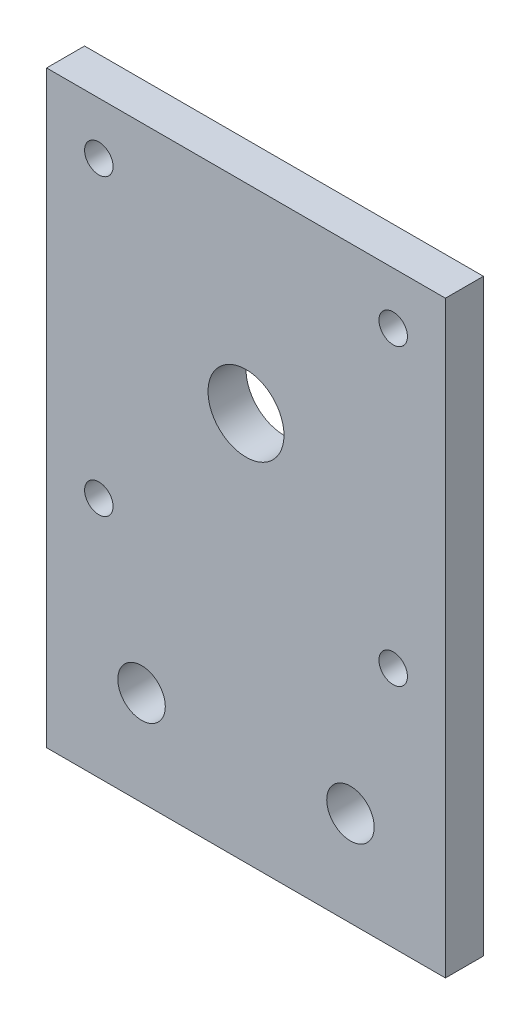
ISO-10303-21;
HEADER;
FILE_DESCRIPTION(('STEP AP214'),'2;1');
FILE_NAME('part.step','',(''),(''),'','','');
FILE_SCHEMA(('AUTOMOTIVE_DESIGN { 1 0 10303 214 1 1 1 1 }'));
ENDSEC;
DATA;
#1=APPLICATION_CONTEXT('core data for automotive mechanical design processes');
#2=APPLICATION_PROTOCOL_DEFINITION('international standard','automotive_design',2000,#1);
#3=PRODUCT_CONTEXT('',#1,'mechanical');
#4=PRODUCT('Part','Part','',(#3));
#5=PRODUCT_RELATED_PRODUCT_CATEGORY('part','',(#4));
#6=PRODUCT_DEFINITION_FORMATION('','',#4);
#7=PRODUCT_DEFINITION_CONTEXT('part definition',#1,'design');
#8=PRODUCT_DEFINITION('design','',#6,#7);
#9=PRODUCT_DEFINITION_SHAPE('','',#8);
#10=(LENGTH_UNIT() NAMED_UNIT(*) SI_UNIT(.MILLI.,.METRE.));
#11=(NAMED_UNIT(*) PLANE_ANGLE_UNIT() SI_UNIT($,.RADIAN.));
#12=(NAMED_UNIT(*) SI_UNIT($,.STERADIAN.) SOLID_ANGLE_UNIT());
#13=UNCERTAINTY_MEASURE_WITH_UNIT(LENGTH_MEASURE(1.E-05),#10,'distance_accuracy_value','');
#14=(GEOMETRIC_REPRESENTATION_CONTEXT(3) GLOBAL_UNCERTAINTY_ASSIGNED_CONTEXT((#13)) GLOBAL_UNIT_ASSIGNED_CONTEXT((#10,
#11,#12)) REPRESENTATION_CONTEXT('',''));
#15=CARTESIAN_POINT('',(0.,0.,0.));
#16=DIRECTION('',(0.,0.,1.));
#17=DIRECTION('',(1.,0.,0.));
#18=AXIS2_PLACEMENT_3D('',#15,#16,#17);
#19=CARTESIAN_POINT('',(0.,0.,4.));
#20=DIRECTION('',(0.,0.,1.));
#21=DIRECTION('',(1.,0.,0.));
#22=AXIS2_PLACEMENT_3D('',#19,#20,#21);
#23=PLANE('',#22);
#24=CARTESIAN_POINT('',(11.,-31.,4.));
#25=DIRECTION('',(0.,0.,1.));
#26=DIRECTION('',(1.,0.,0.));
#27=AXIS2_PLACEMENT_3D('',#24,#25,#26);
#28=CIRCLE('',#27,2.5);
#29=CARTESIAN_POINT('',(13.5,-31.,4.));
#30=VERTEX_POINT('',#29);
#31=EDGE_CURVE('E107',#30,#30,#28,.T.);
#32=ORIENTED_EDGE('',*,*,#31,.F.);
#33=EDGE_LOOP('',(#32));
#34=FACE_BOUND('',#33,.T.);
#35=CARTESIAN_POINT('',(-11.,-31.,4.));
#36=DIRECTION('',(0.,0.,1.));
#37=DIRECTION('',(1.,0.,0.));
#38=AXIS2_PLACEMENT_3D('',#35,#36,#37);
#39=CIRCLE('',#38,2.5);
#40=CARTESIAN_POINT('',(-8.49999999999999,-31.,4.));
#41=VERTEX_POINT('',#40);
#42=EDGE_CURVE('E111',#41,#41,#39,.T.);
#43=ORIENTED_EDGE('',*,*,#42,.F.);
#44=EDGE_LOOP('',(#43));
#45=FACE_BOUND('',#44,.T.);
#46=CARTESIAN_POINT('',(15.5000000000008,-15.4999999999991,4.));
#47=DIRECTION('',(0.,0.,1.));
#48=DIRECTION('',(1.,0.,0.));
#49=AXIS2_PLACEMENT_3D('',#46,#47,#48);
#50=CIRCLE('',#49,1.50000000000121);
#51=CARTESIAN_POINT('',(17.000000000002,-15.4999999999991,4.));
#52=VERTEX_POINT('',#51);
#53=EDGE_CURVE('E128',#52,#52,#50,.T.);
#54=ORIENTED_EDGE('',*,*,#53,.F.);
#55=EDGE_LOOP('',(#54));
#56=FACE_BOUND('',#55,.T.);
#57=CARTESIAN_POINT('',(-15.5,15.5,4.));
#58=DIRECTION('',(0.,0.,1.));
#59=DIRECTION('',(1.,0.,0.));
#60=AXIS2_PLACEMENT_3D('',#57,#58,#59);
#61=CIRCLE('',#60,1.5);
#62=CARTESIAN_POINT('',(-14.,15.5,4.));
#63=VERTEX_POINT('',#62);
#64=EDGE_CURVE('E144',#63,#63,#61,.T.);
#65=ORIENTED_EDGE('',*,*,#64,.F.);
#66=EDGE_LOOP('',(#65));
#67=FACE_BOUND('',#66,.T.);
#68=DIRECTION('',(0.,-1.,0.));
#69=VECTOR('',#68,1.);
#70=CARTESIAN_POINT('',(-21.,-21.,4.));
#71=LINE('',#70,#69);
#72=CARTESIAN_POINT('',(-21.,21.,4.));
#73=VERTEX_POINT('',#72);
#74=CARTESIAN_POINT('',(-21.,-41.,4.));
#75=VERTEX_POINT('',#74);
#76=EDGE_CURVE('E84',#73,#75,#71,.T.);
#77=ORIENTED_EDGE('',*,*,#76,.T.);
#78=DIRECTION('',(-1.,0.,0.));
#79=VECTOR('',#78,1.);
#80=CARTESIAN_POINT('',(-21.,-41.,4.));
#81=LINE('',#80,#79);
#82=CARTESIAN_POINT('',(21.,-41.,4.));
#83=VERTEX_POINT('',#82);
#84=EDGE_CURVE('E88',#83,#75,#81,.T.);
#85=ORIENTED_EDGE('',*,*,#84,.F.);
#86=DIRECTION('',(0.,1.,0.));
#87=VECTOR('',#86,1.);
#88=CARTESIAN_POINT('',(21.,-21.,4.));
#89=LINE('',#88,#87);
#90=CARTESIAN_POINT('',(21.,21.,4.));
#91=VERTEX_POINT('',#90);
#92=EDGE_CURVE('E74',#83,#91,#89,.T.);
#93=ORIENTED_EDGE('',*,*,#92,.T.);
#94=DIRECTION('',(-1.,0.,0.));
#95=VECTOR('',#94,1.);
#96=CARTESIAN_POINT('',(21.,21.,4.));
#97=LINE('',#96,#95);
#98=EDGE_CURVE('E59',#91,#73,#97,.T.);
#99=ORIENTED_EDGE('',*,*,#98,.T.);
#100=EDGE_LOOP('',(#77,#85,#93,#99));
#101=FACE_BOUND('',#100,.T.);
#102=CARTESIAN_POINT('',(0.,0.,4.));
#103=DIRECTION('',(0.,0.,1.));
#104=DIRECTION('',(1.,0.,0.));
#105=AXIS2_PLACEMENT_3D('',#102,#103,#104);
#106=CIRCLE('',#105,4.);
#107=CARTESIAN_POINT('',(4.,0.,4.));
#108=VERTEX_POINT('',#107);
#109=EDGE_CURVE('E152',#108,#108,#106,.T.);
#110=ORIENTED_EDGE('',*,*,#109,.F.);
#111=EDGE_LOOP('',(#110));
#112=FACE_BOUND('',#111,.T.);
#113=CARTESIAN_POINT('',(15.5,15.5000000000008,4.));
#114=DIRECTION('',(0.,0.,1.));
#115=DIRECTION('',(1.,0.,0.));
#116=AXIS2_PLACEMENT_3D('',#113,#114,#115);
#117=CIRCLE('',#116,1.50000000000089);
#118=CARTESIAN_POINT('',(17.0000000000009,15.5000000000008,4.));
#119=VERTEX_POINT('',#118);
#120=EDGE_CURVE('E136',#119,#119,#117,.T.);
#121=ORIENTED_EDGE('',*,*,#120,.F.);
#122=EDGE_LOOP('',(#121));
#123=FACE_BOUND('',#122,.T.);
#124=CARTESIAN_POINT('',(-15.4999999999991,-15.5,4.));
#125=DIRECTION('',(0.,0.,1.));
#126=DIRECTION('',(1.,0.,0.));
#127=AXIS2_PLACEMENT_3D('',#124,#125,#126);
#128=CIRCLE('',#127,1.50000000000046);
#129=CARTESIAN_POINT('',(-13.9999999999987,-15.5,4.));
#130=VERTEX_POINT('',#129);
#131=EDGE_CURVE('E120',#130,#130,#128,.T.);
#132=ORIENTED_EDGE('',*,*,#131,.F.);
#133=EDGE_LOOP('',(#132));
#134=FACE_BOUND('',#133,.T.);
#135=ADVANCED_FACE('F41',(#34,#45,#56,#67,#101,#112,#123,#134),#23,.T.);
#136=CARTESIAN_POINT('',(0.,0.,0.));
#137=DIRECTION('',(0.,0.,1.));
#138=DIRECTION('',(1.,0.,0.));
#139=AXIS2_PLACEMENT_3D('',#136,#137,#138);
#140=PLANE('',#139);
#141=CARTESIAN_POINT('',(11.,-31.,0.));
#142=DIRECTION('',(0.,0.,-1.));
#143=DIRECTION('',(-1.,0.,0.));
#144=AXIS2_PLACEMENT_3D('',#141,#142,#143);
#145=CIRCLE('',#144,2.5);
#146=CARTESIAN_POINT('',(8.5,-31.,0.));
#147=VERTEX_POINT('',#146);
#148=EDGE_CURVE('E227',#147,#147,#145,.T.);
#149=ORIENTED_EDGE('',*,*,#148,.F.);
#150=EDGE_LOOP('',(#149));
#151=FACE_BOUND('',#150,.T.);
#152=CARTESIAN_POINT('',(-11.,-31.,0.));
#153=DIRECTION('',(0.,0.,-1.));
#154=DIRECTION('',(-1.,0.,0.));
#155=AXIS2_PLACEMENT_3D('',#152,#153,#154);
#156=CIRCLE('',#155,2.5);
#157=CARTESIAN_POINT('',(-13.5,-31.,0.));
#158=VERTEX_POINT('',#157);
#159=EDGE_CURVE('E229',#158,#158,#156,.T.);
#160=ORIENTED_EDGE('',*,*,#159,.F.);
#161=EDGE_LOOP('',(#160));
#162=FACE_BOUND('',#161,.T.);
#163=DIRECTION('',(0.,-1.,0.));
#164=VECTOR('',#163,1.);
#165=CARTESIAN_POINT('',(-21.,-21.,0.));
#166=LINE('',#165,#164);
#167=CARTESIAN_POINT('',(-21.,21.,0.));
#168=VERTEX_POINT('',#167);
#169=CARTESIAN_POINT('',(-21.,-41.,0.));
#170=VERTEX_POINT('',#169);
#171=EDGE_CURVE('E97',#168,#170,#166,.T.);
#172=ORIENTED_EDGE('',*,*,#171,.F.);
#173=DIRECTION('',(-1.,0.,0.));
#174=VECTOR('',#173,1.);
#175=CARTESIAN_POINT('',(21.,21.,0.));
#176=LINE('',#175,#174);
#177=CARTESIAN_POINT('',(21.,21.,0.));
#178=VERTEX_POINT('',#177);
#179=EDGE_CURVE('E92',#178,#168,#176,.T.);
#180=ORIENTED_EDGE('',*,*,#179,.F.);
#181=DIRECTION('',(0.,1.,0.));
#182=VECTOR('',#181,1.);
#183=CARTESIAN_POINT('',(21.,-21.,0.));
#184=LINE('',#183,#182);
#185=CARTESIAN_POINT('',(21.,-41.,0.));
#186=VERTEX_POINT('',#185);
#187=EDGE_CURVE('E70',#186,#178,#184,.T.);
#188=ORIENTED_EDGE('',*,*,#187,.F.);
#189=DIRECTION('',(1.,0.,0.));
#190=VECTOR('',#189,1.);
#191=CARTESIAN_POINT('',(-21.,-41.,0.));
#192=LINE('',#191,#190);
#193=EDGE_CURVE('E102',#170,#186,#192,.T.);
#194=ORIENTED_EDGE('',*,*,#193,.F.);
#195=EDGE_LOOP('',(#172,#180,#188,#194));
#196=FACE_BOUND('',#195,.T.);
#197=CARTESIAN_POINT('',(0.,0.,0.));
#198=DIRECTION('',(0.,0.,1.));
#199=DIRECTION('',(1.,0.,0.));
#200=AXIS2_PLACEMENT_3D('',#197,#198,#199);
#201=CIRCLE('',#200,4.);
#202=CARTESIAN_POINT('',(4.,0.,0.));
#203=VERTEX_POINT('',#202);
#204=EDGE_CURVE('E148',#203,#203,#201,.T.);
#205=ORIENTED_EDGE('',*,*,#204,.T.);
#206=EDGE_LOOP('',(#205));
#207=FACE_BOUND('',#206,.T.);
#208=CARTESIAN_POINT('',(-15.5,15.5,0.));
#209=DIRECTION('',(0.,0.,1.));
#210=DIRECTION('',(1.,0.,0.));
#211=AXIS2_PLACEMENT_3D('',#208,#209,#210);
#212=CIRCLE('',#211,1.5);
#213=CARTESIAN_POINT('',(-14.,15.5,0.));
#214=VERTEX_POINT('',#213);
#215=EDGE_CURVE('E140',#214,#214,#212,.T.);
#216=ORIENTED_EDGE('',*,*,#215,.T.);
#217=EDGE_LOOP('',(#216));
#218=FACE_BOUND('',#217,.T.);
#219=CARTESIAN_POINT('',(15.5,15.5000000000008,0.));
#220=DIRECTION('',(0.,0.,1.));
#221=DIRECTION('',(1.,0.,0.));
#222=AXIS2_PLACEMENT_3D('',#219,#220,#221);
#223=CIRCLE('',#222,1.50000000000089);
#224=CARTESIAN_POINT('',(17.0000000000009,15.5000000000008,0.));
#225=VERTEX_POINT('',#224);
#226=EDGE_CURVE('E132',#225,#225,#223,.T.);
#227=ORIENTED_EDGE('',*,*,#226,.T.);
#228=EDGE_LOOP('',(#227));
#229=FACE_BOUND('',#228,.T.);
#230=CARTESIAN_POINT('',(15.5000000000008,-15.4999999999991,0.));
#231=DIRECTION('',(0.,0.,1.));
#232=DIRECTION('',(1.,0.,0.));
#233=AXIS2_PLACEMENT_3D('',#230,#231,#232);
#234=CIRCLE('',#233,1.50000000000121);
#235=CARTESIAN_POINT('',(17.000000000002,-15.4999999999991,0.));
#236=VERTEX_POINT('',#235);
#237=EDGE_CURVE('E124',#236,#236,#234,.T.);
#238=ORIENTED_EDGE('',*,*,#237,.T.);
#239=EDGE_LOOP('',(#238));
#240=FACE_BOUND('',#239,.T.);
#241=CARTESIAN_POINT('',(-15.4999999999991,-15.5,0.));
#242=DIRECTION('',(0.,0.,1.));
#243=DIRECTION('',(1.,0.,0.));
#244=AXIS2_PLACEMENT_3D('',#241,#242,#243);
#245=CIRCLE('',#244,1.50000000000046);
#246=CARTESIAN_POINT('',(-13.9999999999987,-15.5,0.));
#247=VERTEX_POINT('',#246);
#248=EDGE_CURVE('E119',#247,#247,#245,.T.);
#249=ORIENTED_EDGE('',*,*,#248,.T.);
#250=EDGE_LOOP('',(#249));
#251=FACE_BOUND('',#250,.T.);
#252=ADVANCED_FACE('F172',(#151,#162,#196,#207,#218,#229,#240,#251),#140,.F.);
#253=CARTESIAN_POINT('',(-21.,-21.,4.));
#254=DIRECTION('',(1.,0.,0.));
#255=DIRECTION('',(0.,0.,-1.));
#256=AXIS2_PLACEMENT_3D('',#253,#254,#255);
#257=PLANE('',#256);
#258=ORIENTED_EDGE('',*,*,#171,.T.);
#259=DIRECTION('',(0.,0.,-1.));
#260=VECTOR('',#259,1.);
#261=CARTESIAN_POINT('',(-21.,-41.,4.));
#262=LINE('',#261,#260);
#263=EDGE_CURVE('E95',#75,#170,#262,.T.);
#264=ORIENTED_EDGE('',*,*,#263,.F.);
#265=ORIENTED_EDGE('',*,*,#76,.F.);
#266=DIRECTION('',(0.,0.,-1.));
#267=VECTOR('',#266,1.);
#268=CARTESIAN_POINT('',(-21.,21.,4.));
#269=LINE('',#268,#267);
#270=EDGE_CURVE('E51',#73,#168,#269,.T.);
#271=ORIENTED_EDGE('',*,*,#270,.T.);
#272=EDGE_LOOP('',(#258,#264,#265,#271));
#273=FACE_BOUND('',#272,.T.);
#274=ADVANCED_FACE('F43',(#273),#257,.F.);
#275=CARTESIAN_POINT('',(21.,-21.,4.));
#276=DIRECTION('',(-1.,0.,0.));
#277=DIRECTION('',(0.,0.,1.));
#278=AXIS2_PLACEMENT_3D('',#275,#276,#277);
#279=PLANE('',#278);
#280=ORIENTED_EDGE('',*,*,#187,.T.);
#281=DIRECTION('',(0.,0.,-1.));
#282=VECTOR('',#281,1.);
#283=CARTESIAN_POINT('',(21.,21.,4.));
#284=LINE('',#283,#282);
#285=EDGE_CURVE('E11',#91,#178,#284,.T.);
#286=ORIENTED_EDGE('',*,*,#285,.F.);
#287=ORIENTED_EDGE('',*,*,#92,.F.);
#288=DIRECTION('',(0.,0.,1.));
#289=VECTOR('',#288,1.);
#290=CARTESIAN_POINT('',(21.,-41.,4.));
#291=LINE('',#290,#289);
#292=EDGE_CURVE('E105',#186,#83,#291,.T.);
#293=ORIENTED_EDGE('',*,*,#292,.F.);
#294=EDGE_LOOP('',(#280,#286,#287,#293));
#295=FACE_BOUND('',#294,.T.);
#296=ADVANCED_FACE('F174',(#295),#279,.F.);
#297=CARTESIAN_POINT('',(21.,21.,4.));
#298=DIRECTION('',(0.,-1.,0.));
#299=DIRECTION('',(1.,0.,0.));
#300=AXIS2_PLACEMENT_3D('',#297,#298,#299);
#301=PLANE('',#300);
#302=ORIENTED_EDGE('',*,*,#179,.T.);
#303=ORIENTED_EDGE('',*,*,#270,.F.);
#304=ORIENTED_EDGE('',*,*,#98,.F.);
#305=ORIENTED_EDGE('',*,*,#285,.T.);
#306=EDGE_LOOP('',(#302,#303,#304,#305));
#307=FACE_BOUND('',#306,.T.);
#308=ADVANCED_FACE('F176',(#307),#301,.F.);
#309=CARTESIAN_POINT('',(0.,0.,4.));
#310=DIRECTION('',(0.,0.,-1.));
#311=DIRECTION('',(-1.,0.,0.));
#312=AXIS2_PLACEMENT_3D('',#309,#310,#311);
#313=CYLINDRICAL_SURFACE('',#312,4.);
#314=ORIENTED_EDGE('',*,*,#109,.T.);
#315=EDGE_LOOP('',(#314));
#316=FACE_BOUND('',#315,.T.);
#317=ORIENTED_EDGE('',*,*,#204,.F.);
#318=EDGE_LOOP('',(#317));
#319=FACE_BOUND('',#318,.T.);
#320=ADVANCED_FACE('F182',(#316,#319),#313,.F.);
#321=CARTESIAN_POINT('',(-15.5,15.5,4.));
#322=DIRECTION('',(0.,0.,-1.));
#323=DIRECTION('',(-1.,0.,0.));
#324=AXIS2_PLACEMENT_3D('',#321,#322,#323);
#325=CYLINDRICAL_SURFACE('',#324,1.5);
#326=ORIENTED_EDGE('',*,*,#64,.T.);
#327=EDGE_LOOP('',(#326));
#328=FACE_BOUND('',#327,.T.);
#329=ORIENTED_EDGE('',*,*,#215,.F.);
#330=EDGE_LOOP('',(#329));
#331=FACE_BOUND('',#330,.T.);
#332=ADVANCED_FACE('F198',(#328,#331),#325,.F.);
#333=CARTESIAN_POINT('',(15.5,15.5000000000008,4.));
#334=DIRECTION('',(0.,0.,-1.));
#335=DIRECTION('',(-1.,0.,0.));
#336=AXIS2_PLACEMENT_3D('',#333,#334,#335);
#337=CYLINDRICAL_SURFACE('',#336,1.50000000000089);
#338=ORIENTED_EDGE('',*,*,#120,.T.);
#339=EDGE_LOOP('',(#338));
#340=FACE_BOUND('',#339,.T.);
#341=ORIENTED_EDGE('',*,*,#226,.F.);
#342=EDGE_LOOP('',(#341));
#343=FACE_BOUND('',#342,.T.);
#344=ADVANCED_FACE('F202',(#340,#343),#337,.F.);
#345=CARTESIAN_POINT('',(15.5000000000008,-15.4999999999991,4.));
#346=DIRECTION('',(0.,0.,-1.));
#347=DIRECTION('',(-1.,0.,0.));
#348=AXIS2_PLACEMENT_3D('',#345,#346,#347);
#349=CYLINDRICAL_SURFACE('',#348,1.50000000000121);
#350=ORIENTED_EDGE('',*,*,#53,.T.);
#351=EDGE_LOOP('',(#350));
#352=FACE_BOUND('',#351,.T.);
#353=ORIENTED_EDGE('',*,*,#237,.F.);
#354=EDGE_LOOP('',(#353));
#355=FACE_BOUND('',#354,.T.);
#356=ADVANCED_FACE('F206',(#352,#355),#349,.F.);
#357=CARTESIAN_POINT('',(-15.4999999999991,-15.5,4.));
#358=DIRECTION('',(0.,0.,-1.));
#359=DIRECTION('',(-1.,0.,0.));
#360=AXIS2_PLACEMENT_3D('',#357,#358,#359);
#361=CYLINDRICAL_SURFACE('',#360,1.50000000000046);
#362=ORIENTED_EDGE('',*,*,#131,.T.);
#363=EDGE_LOOP('',(#362));
#364=FACE_BOUND('',#363,.T.);
#365=ORIENTED_EDGE('',*,*,#248,.F.);
#366=EDGE_LOOP('',(#365));
#367=FACE_BOUND('',#366,.T.);
#368=ADVANCED_FACE('F210',(#364,#367),#361,.F.);
#369=CARTESIAN_POINT('',(0.,-41.,0.));
#370=DIRECTION('',(0.,1.,0.));
#371=DIRECTION('',(-1.,0.,0.));
#372=AXIS2_PLACEMENT_3D('',#369,#370,#371);
#373=PLANE('',#372);
#374=ORIENTED_EDGE('',*,*,#84,.T.);
#375=ORIENTED_EDGE('',*,*,#263,.T.);
#376=ORIENTED_EDGE('',*,*,#193,.T.);
#377=ORIENTED_EDGE('',*,*,#292,.T.);
#378=EDGE_LOOP('',(#374,#375,#376,#377));
#379=FACE_BOUND('',#378,.T.);
#380=ADVANCED_FACE('F104',(#379),#373,.F.);
#381=CARTESIAN_POINT('',(-11.,-31.,20.));
#382=DIRECTION('',(0.,0.,-1.));
#383=DIRECTION('',(-1.,0.,0.));
#384=AXIS2_PLACEMENT_3D('',#381,#382,#383);
#385=CYLINDRICAL_SURFACE('',#384,2.5);
#386=ORIENTED_EDGE('',*,*,#42,.T.);
#387=EDGE_LOOP('',(#386));
#388=FACE_BOUND('',#387,.T.);
#389=ORIENTED_EDGE('',*,*,#159,.T.);
#390=EDGE_LOOP('',(#389));
#391=FACE_BOUND('',#390,.T.);
#392=ADVANCED_FACE('F215',(#388,#391),#385,.F.);
#393=CARTESIAN_POINT('',(11.,-31.,20.));
#394=DIRECTION('',(0.,0.,-1.));
#395=DIRECTION('',(-1.,0.,0.));
#396=AXIS2_PLACEMENT_3D('',#393,#394,#395);
#397=CYLINDRICAL_SURFACE('',#396,2.5);
#398=ORIENTED_EDGE('',*,*,#31,.T.);
#399=EDGE_LOOP('',(#398));
#400=FACE_BOUND('',#399,.T.);
#401=ORIENTED_EDGE('',*,*,#148,.T.);
#402=EDGE_LOOP('',(#401));
#403=FACE_BOUND('',#402,.T.);
#404=ADVANCED_FACE('F218',(#400,#403),#397,.F.);
#405=CLOSED_SHELL('',(#135,#252,#274,#296,#308,#320,#332,#344,#356,#368,#380,#392,#404));
#406=MANIFOLD_SOLID_BREP('B2',#405);
#407=ADVANCED_BREP_SHAPE_REPRESENTATION('',(#18,#406),#14);
#408=SHAPE_DEFINITION_REPRESENTATION(#9,#407);
ENDSEC;
END-ISO-10303-21;
